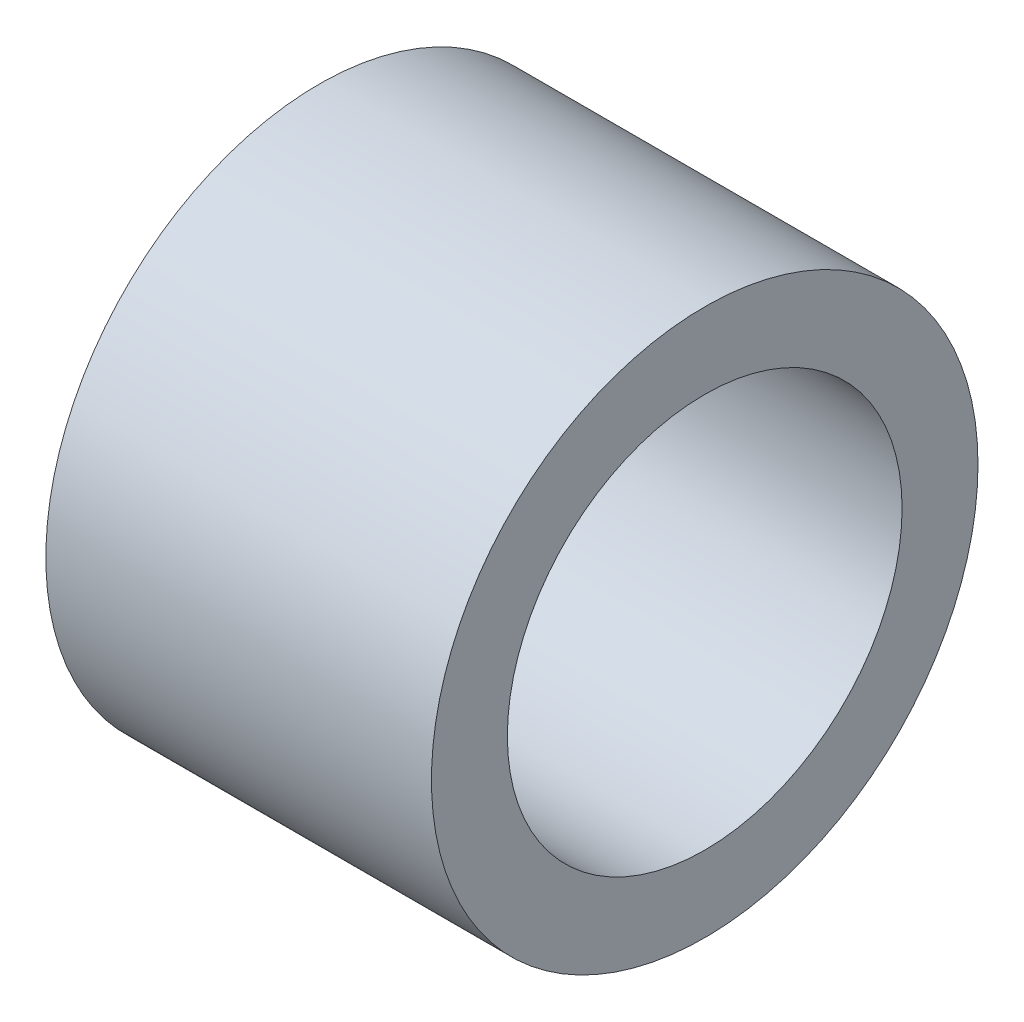
ISO-10303-21;
HEADER;
FILE_DESCRIPTION(('STEP AP214'),'2;1');
FILE_NAME('part.step','',(''),(''),'','','');
FILE_SCHEMA(('AUTOMOTIVE_DESIGN { 1 0 10303 214 1 1 1 1 }'));
ENDSEC;
DATA;
#1=APPLICATION_CONTEXT('core data for automotive mechanical design processes');
#2=APPLICATION_PROTOCOL_DEFINITION('international standard','automotive_design',2000,#1);
#3=PRODUCT_CONTEXT('',#1,'mechanical');
#4=PRODUCT('Part','Part','',(#3));
#5=PRODUCT_RELATED_PRODUCT_CATEGORY('part','',(#4));
#6=PRODUCT_DEFINITION_FORMATION('','',#4);
#7=PRODUCT_DEFINITION_CONTEXT('part definition',#1,'design');
#8=PRODUCT_DEFINITION('design','',#6,#7);
#9=PRODUCT_DEFINITION_SHAPE('','',#8);
#10=(LENGTH_UNIT() NAMED_UNIT(*) SI_UNIT(.MILLI.,.METRE.));
#11=(NAMED_UNIT(*) PLANE_ANGLE_UNIT() SI_UNIT($,.RADIAN.));
#12=(NAMED_UNIT(*) SI_UNIT($,.STERADIAN.) SOLID_ANGLE_UNIT());
#13=UNCERTAINTY_MEASURE_WITH_UNIT(LENGTH_MEASURE(1.E-05),#10,'distance_accuracy_value','');
#14=(GEOMETRIC_REPRESENTATION_CONTEXT(3) GLOBAL_UNCERTAINTY_ASSIGNED_CONTEXT((#13)) GLOBAL_UNIT_ASSIGNED_CONTEXT((#10,
#11,#12)) REPRESENTATION_CONTEXT('',''));
#15=CARTESIAN_POINT('',(0.,0.,0.));
#16=DIRECTION('',(0.,0.,1.));
#17=DIRECTION('',(1.,0.,0.));
#18=AXIS2_PLACEMENT_3D('',#15,#16,#17);
#19=CARTESIAN_POINT('',(12.7,0.,0.));
#20=DIRECTION('',(1.,0.,0.));
#21=DIRECTION('',(0.,0.,-1.));
#22=AXIS2_PLACEMENT_3D('',#19,#20,#21);
#23=PLANE('',#22);
#24=CARTESIAN_POINT('',(12.7,0.,0.));
#25=DIRECTION('',(1.,0.,0.));
#26=DIRECTION('',(0.,0.,-1.));
#27=AXIS2_PLACEMENT_3D('',#24,#25,#26);
#28=CIRCLE('',#27,9.);
#29=CARTESIAN_POINT('',(12.7,0.,-9.));
#30=VERTEX_POINT('',#29);
#31=EDGE_CURVE('E10',#30,#30,#28,.T.);
#32=ORIENTED_EDGE('',*,*,#31,.T.);
#33=EDGE_LOOP('',(#32));
#34=FACE_BOUND('',#33,.T.);
#35=CARTESIAN_POINT('',(12.7,0.,0.));
#36=DIRECTION('',(1.,0.,0.));
#37=DIRECTION('',(0.,0.,-1.));
#38=AXIS2_PLACEMENT_3D('',#35,#36,#37);
#39=CIRCLE('',#38,6.5);
#40=CARTESIAN_POINT('',(12.7,0.,-6.5));
#41=VERTEX_POINT('',#40);
#42=EDGE_CURVE('E42',#41,#41,#39,.T.);
#43=ORIENTED_EDGE('',*,*,#42,.F.);
#44=EDGE_LOOP('',(#43));
#45=FACE_BOUND('',#44,.T.);
#46=ADVANCED_FACE('F31',(#34,#45),#23,.T.);
#47=CARTESIAN_POINT('',(0.,0.,0.));
#48=DIRECTION('',(1.,0.,0.));
#49=DIRECTION('',(0.,0.,-1.));
#50=AXIS2_PLACEMENT_3D('',#47,#48,#49);
#51=PLANE('',#50);
#52=CARTESIAN_POINT('',(0.,0.,0.));
#53=DIRECTION('',(1.,0.,0.));
#54=DIRECTION('',(0.,0.,-1.));
#55=AXIS2_PLACEMENT_3D('',#52,#53,#54);
#56=CIRCLE('',#55,9.);
#57=CARTESIAN_POINT('',(0.,0.,-9.));
#58=VERTEX_POINT('',#57);
#59=EDGE_CURVE('E35',#58,#58,#56,.T.);
#60=ORIENTED_EDGE('',*,*,#59,.F.);
#61=EDGE_LOOP('',(#60));
#62=FACE_BOUND('',#61,.T.);
#63=CARTESIAN_POINT('',(0.,0.,0.));
#64=DIRECTION('',(1.,0.,0.));
#65=DIRECTION('',(0.,0.,-1.));
#66=AXIS2_PLACEMENT_3D('',#63,#64,#65);
#67=CIRCLE('',#66,6.5);
#68=CARTESIAN_POINT('',(0.,0.,-6.5));
#69=VERTEX_POINT('',#68);
#70=EDGE_CURVE('E44',#69,#69,#67,.T.);
#71=ORIENTED_EDGE('',*,*,#70,.T.);
#72=EDGE_LOOP('',(#71));
#73=FACE_BOUND('',#72,.T.);
#74=ADVANCED_FACE('F54',(#62,#73),#51,.F.);
#75=CARTESIAN_POINT('',(12.7,0.,0.));
#76=DIRECTION('',(-1.,0.,0.));
#77=DIRECTION('',(0.,0.,1.));
#78=AXIS2_PLACEMENT_3D('',#75,#76,#77);
#79=CYLINDRICAL_SURFACE('',#78,9.);
#80=ORIENTED_EDGE('',*,*,#31,.F.);
#81=EDGE_LOOP('',(#80));
#82=FACE_BOUND('',#81,.T.);
#83=ORIENTED_EDGE('',*,*,#59,.T.);
#84=EDGE_LOOP('',(#83));
#85=FACE_BOUND('',#84,.T.);
#86=ADVANCED_FACE('F33',(#82,#85),#79,.T.);
#87=CARTESIAN_POINT('',(12.7,0.,0.));
#88=DIRECTION('',(-1.,0.,0.));
#89=DIRECTION('',(0.,0.,1.));
#90=AXIS2_PLACEMENT_3D('',#87,#88,#89);
#91=CYLINDRICAL_SURFACE('',#90,6.5);
#92=ORIENTED_EDGE('',*,*,#42,.T.);
#93=EDGE_LOOP('',(#92));
#94=FACE_BOUND('',#93,.T.);
#95=ORIENTED_EDGE('',*,*,#70,.F.);
#96=EDGE_LOOP('',(#95));
#97=FACE_BOUND('',#96,.T.);
#98=ADVANCED_FACE('F50',(#94,#97),#91,.F.);
#99=CLOSED_SHELL('',(#46,#74,#86,#98));
#100=MANIFOLD_SOLID_BREP('B2',#99);
#101=ADVANCED_BREP_SHAPE_REPRESENTATION('',(#18,#100),#14);
#102=SHAPE_DEFINITION_REPRESENTATION(#9,#101);
ENDSEC;
END-ISO-10303-21;
